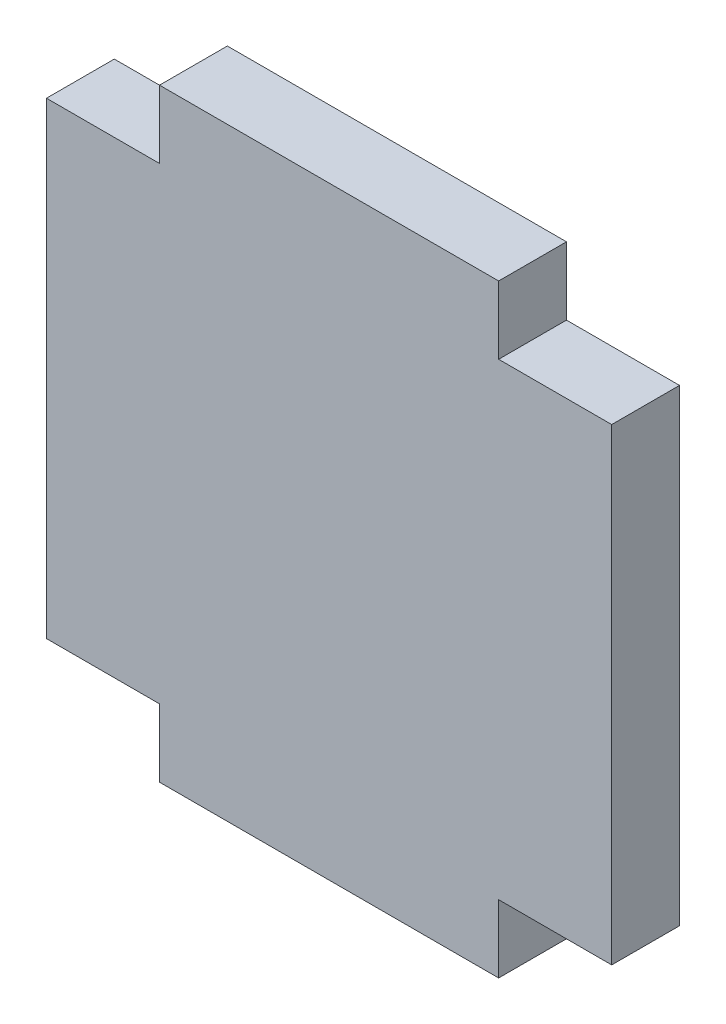
ISO-10303-21;
HEADER;
FILE_DESCRIPTION(('STEP AP214'),'2;1');
FILE_NAME('part.step','',(''),(''),'','','');
FILE_SCHEMA(('AUTOMOTIVE_DESIGN { 1 0 10303 214 1 1 1 1 }'));
ENDSEC;
DATA;
#1=APPLICATION_CONTEXT('core data for automotive mechanical design processes');
#2=APPLICATION_PROTOCOL_DEFINITION('international standard','automotive_design',2000,#1);
#3=PRODUCT_CONTEXT('',#1,'mechanical');
#4=PRODUCT('Part','Part','',(#3));
#5=PRODUCT_RELATED_PRODUCT_CATEGORY('part','',(#4));
#6=PRODUCT_DEFINITION_FORMATION('','',#4);
#7=PRODUCT_DEFINITION_CONTEXT('part definition',#1,'design');
#8=PRODUCT_DEFINITION('design','',#6,#7);
#9=PRODUCT_DEFINITION_SHAPE('','',#8);
#10=(LENGTH_UNIT() NAMED_UNIT(*) SI_UNIT(.MILLI.,.METRE.));
#11=(NAMED_UNIT(*) PLANE_ANGLE_UNIT() SI_UNIT($,.RADIAN.));
#12=(NAMED_UNIT(*) SI_UNIT($,.STERADIAN.) SOLID_ANGLE_UNIT());
#13=UNCERTAINTY_MEASURE_WITH_UNIT(LENGTH_MEASURE(1.E-05),#10,'distance_accuracy_value','');
#14=(GEOMETRIC_REPRESENTATION_CONTEXT(3) GLOBAL_UNCERTAINTY_ASSIGNED_CONTEXT((#13)) GLOBAL_UNIT_ASSIGNED_CONTEXT((#10,
#11,#12)) REPRESENTATION_CONTEXT('',''));
#15=CARTESIAN_POINT('',(0.,0.,0.));
#16=DIRECTION('',(0.,0.,1.));
#17=DIRECTION('',(1.,0.,0.));
#18=AXIS2_PLACEMENT_3D('',#15,#16,#17);
#19=CARTESIAN_POINT('',(0.,-10.35,3.));
#20=DIRECTION('',(0.,1.,0.));
#21=DIRECTION('',(0.,0.,1.));
#22=AXIS2_PLACEMENT_3D('',#19,#20,#21);
#23=PLANE('',#22);
#24=DIRECTION('',(1.,0.,0.));
#25=VECTOR('',#24,1.);
#26=CARTESIAN_POINT('',(0.,-10.35,0.));
#27=LINE('',#26,#25);
#28=CARTESIAN_POINT('',(-12.5,-10.35,0.));
#29=VERTEX_POINT('',#28);
#30=CARTESIAN_POINT('',(-7.5,-10.35,0.));
#31=VERTEX_POINT('',#30);
#32=EDGE_CURVE('E212',#29,#31,#27,.T.);
#33=ORIENTED_EDGE('',*,*,#32,.T.);
#34=DIRECTION('',(0.,0.,-1.));
#35=VECTOR('',#34,1.);
#36=CARTESIAN_POINT('',(-7.5,-10.35,3.));
#37=LINE('',#36,#35);
#38=CARTESIAN_POINT('',(-7.5,-10.35,3.));
#39=VERTEX_POINT('',#38);
#40=EDGE_CURVE('E11',#39,#31,#37,.T.);
#41=ORIENTED_EDGE('',*,*,#40,.F.);
#42=DIRECTION('',(1.,0.,0.));
#43=VECTOR('',#42,1.);
#44=CARTESIAN_POINT('',(0.,-10.35,3.));
#45=LINE('',#44,#43);
#46=CARTESIAN_POINT('',(-12.5,-10.35,3.));
#47=VERTEX_POINT('',#46);
#48=EDGE_CURVE('E102',#47,#39,#45,.T.);
#49=ORIENTED_EDGE('',*,*,#48,.F.);
#50=DIRECTION('',(0.,0.,-1.));
#51=VECTOR('',#50,1.);
#52=CARTESIAN_POINT('',(-12.5,-10.35,3.));
#53=LINE('',#52,#51);
#54=EDGE_CURVE('E53',#47,#29,#53,.T.);
#55=ORIENTED_EDGE('',*,*,#54,.T.);
#56=EDGE_LOOP('',(#33,#41,#49,#55));
#57=FACE_BOUND('',#56,.T.);
#58=ADVANCED_FACE('F36',(#57),#23,.F.);
#59=CARTESIAN_POINT('',(-7.5,0.,3.));
#60=DIRECTION('',(-1.,0.,0.));
#61=DIRECTION('',(0.,0.,1.));
#62=AXIS2_PLACEMENT_3D('',#59,#60,#61);
#63=PLANE('',#62);
#64=DIRECTION('',(0.,1.,0.));
#65=VECTOR('',#64,1.);
#66=CARTESIAN_POINT('',(-7.5,0.,0.));
#67=LINE('',#66,#65);
#68=CARTESIAN_POINT('',(-7.5,-13.35,0.));
#69=VERTEX_POINT('',#68);
#70=EDGE_CURVE('E211',#69,#31,#67,.T.);
#71=ORIENTED_EDGE('',*,*,#70,.F.);
#72=DIRECTION('',(0.,0.,-1.));
#73=VECTOR('',#72,1.);
#74=CARTESIAN_POINT('',(-7.5,-13.35,3.));
#75=LINE('',#74,#73);
#76=CARTESIAN_POINT('',(-7.5,-13.35,3.));
#77=VERTEX_POINT('',#76);
#78=EDGE_CURVE('E45',#77,#69,#75,.T.);
#79=ORIENTED_EDGE('',*,*,#78,.F.);
#80=DIRECTION('',(0.,1.,0.));
#81=VECTOR('',#80,1.);
#82=CARTESIAN_POINT('',(-7.5,0.,3.));
#83=LINE('',#82,#81);
#84=EDGE_CURVE('E174',#77,#39,#83,.T.);
#85=ORIENTED_EDGE('',*,*,#84,.T.);
#86=ORIENTED_EDGE('',*,*,#40,.T.);
#87=EDGE_LOOP('',(#71,#79,#85,#86));
#88=FACE_BOUND('',#87,.T.);
#89=ADVANCED_FACE('F38',(#88),#63,.T.);
#90=CARTESIAN_POINT('',(0.,-13.35,3.));
#91=DIRECTION('',(0.,-1.,0.));
#92=DIRECTION('',(0.,0.,-1.));
#93=AXIS2_PLACEMENT_3D('',#90,#91,#92);
#94=PLANE('',#93);
#95=DIRECTION('',(-1.,0.,0.));
#96=VECTOR('',#95,1.);
#97=CARTESIAN_POINT('',(0.,-13.35,0.));
#98=LINE('',#97,#96);
#99=CARTESIAN_POINT('',(7.5,-13.35,0.));
#100=VERTEX_POINT('',#99);
#101=EDGE_CURVE('E207',#100,#69,#98,.T.);
#102=ORIENTED_EDGE('',*,*,#101,.F.);
#103=DIRECTION('',(0.,0.,-1.));
#104=VECTOR('',#103,1.);
#105=CARTESIAN_POINT('',(7.5,-13.35,3.));
#106=LINE('',#105,#104);
#107=CARTESIAN_POINT('',(7.5,-13.35,3.));
#108=VERTEX_POINT('',#107);
#109=EDGE_CURVE('E201',#108,#100,#106,.T.);
#110=ORIENTED_EDGE('',*,*,#109,.F.);
#111=DIRECTION('',(-1.,0.,0.));
#112=VECTOR('',#111,1.);
#113=CARTESIAN_POINT('',(0.,-13.35,3.));
#114=LINE('',#113,#112);
#115=EDGE_CURVE('E171',#108,#77,#114,.T.);
#116=ORIENTED_EDGE('',*,*,#115,.T.);
#117=ORIENTED_EDGE('',*,*,#78,.T.);
#118=EDGE_LOOP('',(#102,#110,#116,#117));
#119=FACE_BOUND('',#118,.T.);
#120=ADVANCED_FACE('F205',(#119),#94,.T.);
#121=CARTESIAN_POINT('',(7.5,0.,3.));
#122=DIRECTION('',(-1.,0.,0.));
#123=DIRECTION('',(0.,0.,1.));
#124=AXIS2_PLACEMENT_3D('',#121,#122,#123);
#125=PLANE('',#124);
#126=DIRECTION('',(0.,1.,0.));
#127=VECTOR('',#126,1.);
#128=CARTESIAN_POINT('',(7.5,0.,0.));
#129=LINE('',#128,#127);
#130=CARTESIAN_POINT('',(7.5,-10.35,0.));
#131=VERTEX_POINT('',#130);
#132=EDGE_CURVE('E217',#100,#131,#129,.T.);
#133=ORIENTED_EDGE('',*,*,#132,.T.);
#134=DIRECTION('',(0.,0.,-1.));
#135=VECTOR('',#134,1.);
#136=CARTESIAN_POINT('',(7.5,-10.35,3.));
#137=LINE('',#136,#135);
#138=CARTESIAN_POINT('',(7.5,-10.35,3.));
#139=VERTEX_POINT('',#138);
#140=EDGE_CURVE('E198',#139,#131,#137,.T.);
#141=ORIENTED_EDGE('',*,*,#140,.F.);
#142=DIRECTION('',(0.,1.,0.));
#143=VECTOR('',#142,1.);
#144=CARTESIAN_POINT('',(7.5,0.,3.));
#145=LINE('',#144,#143);
#146=EDGE_CURVE('E167',#108,#139,#145,.T.);
#147=ORIENTED_EDGE('',*,*,#146,.F.);
#148=ORIENTED_EDGE('',*,*,#109,.T.);
#149=EDGE_LOOP('',(#133,#141,#147,#148));
#150=FACE_BOUND('',#149,.T.);
#151=ADVANCED_FACE('F264',(#150),#125,.F.);
#152=CARTESIAN_POINT('',(12.5,-10.35,0.));
#153=VERTEX_POINT('',#152);
#154=EDGE_CURVE('E219',#131,#153,#27,.T.);
#155=ORIENTED_EDGE('',*,*,#154,.T.);
#156=DIRECTION('',(0.,0.,-1.));
#157=VECTOR('',#156,1.);
#158=CARTESIAN_POINT('',(12.5,-10.35,3.));
#159=LINE('',#158,#157);
#160=CARTESIAN_POINT('',(12.5,-10.35,3.));
#161=VERTEX_POINT('',#160);
#162=EDGE_CURVE('E195',#161,#153,#159,.T.);
#163=ORIENTED_EDGE('',*,*,#162,.F.);
#164=EDGE_CURVE('E164',#139,#161,#45,.T.);
#165=ORIENTED_EDGE('',*,*,#164,.F.);
#166=ORIENTED_EDGE('',*,*,#140,.T.);
#167=EDGE_LOOP('',(#155,#163,#165,#166));
#168=FACE_BOUND('',#167,.T.);
#169=ADVANCED_FACE('F244',(#168),#23,.F.);
#170=CARTESIAN_POINT('',(12.5,0.,3.));
#171=DIRECTION('',(-1.,0.,0.));
#172=DIRECTION('',(0.,0.,1.));
#173=AXIS2_PLACEMENT_3D('',#170,#171,#172);
#174=PLANE('',#173);
#175=DIRECTION('',(0.,1.,0.));
#176=VECTOR('',#175,1.);
#177=CARTESIAN_POINT('',(12.5,0.,0.));
#178=LINE('',#177,#176);
#179=CARTESIAN_POINT('',(12.5,10.35,0.));
#180=VERTEX_POINT('',#179);
#181=EDGE_CURVE('E223',#153,#180,#178,.T.);
#182=ORIENTED_EDGE('',*,*,#181,.T.);
#183=DIRECTION('',(0.,0.,-1.));
#184=VECTOR('',#183,1.);
#185=CARTESIAN_POINT('',(12.5,10.35,3.));
#186=LINE('',#185,#184);
#187=CARTESIAN_POINT('',(12.5,10.35,3.));
#188=VERTEX_POINT('',#187);
#189=EDGE_CURVE('E193',#188,#180,#186,.T.);
#190=ORIENTED_EDGE('',*,*,#189,.F.);
#191=DIRECTION('',(0.,1.,0.));
#192=VECTOR('',#191,1.);
#193=CARTESIAN_POINT('',(12.5,0.,3.));
#194=LINE('',#193,#192);
#195=EDGE_CURVE('E160',#161,#188,#194,.T.);
#196=ORIENTED_EDGE('',*,*,#195,.F.);
#197=ORIENTED_EDGE('',*,*,#162,.T.);
#198=EDGE_LOOP('',(#182,#190,#196,#197));
#199=FACE_BOUND('',#198,.T.);
#200=ADVANCED_FACE('F240',(#199),#174,.F.);
#201=CARTESIAN_POINT('',(0.,10.35,3.));
#202=DIRECTION('',(0.,1.,0.));
#203=DIRECTION('',(0.,0.,1.));
#204=AXIS2_PLACEMENT_3D('',#201,#202,#203);
#205=PLANE('',#204);
#206=DIRECTION('',(1.,0.,0.));
#207=VECTOR('',#206,1.);
#208=CARTESIAN_POINT('',(0.,10.35,0.));
#209=LINE('',#208,#207);
#210=CARTESIAN_POINT('',(7.5,10.35,0.));
#211=VERTEX_POINT('',#210);
#212=EDGE_CURVE('E182',#211,#180,#209,.T.);
#213=ORIENTED_EDGE('',*,*,#212,.F.);
#214=DIRECTION('',(0.,0.,-1.));
#215=VECTOR('',#214,1.);
#216=CARTESIAN_POINT('',(7.5,10.35,3.));
#217=LINE('',#216,#215);
#218=CARTESIAN_POINT('',(7.5,10.35,3.));
#219=VERTEX_POINT('',#218);
#220=EDGE_CURVE('E191',#219,#211,#217,.T.);
#221=ORIENTED_EDGE('',*,*,#220,.F.);
#222=DIRECTION('',(1.,0.,0.));
#223=VECTOR('',#222,1.);
#224=CARTESIAN_POINT('',(0.,10.35,3.));
#225=LINE('',#224,#223);
#226=EDGE_CURVE('E154',#219,#188,#225,.T.);
#227=ORIENTED_EDGE('',*,*,#226,.T.);
#228=ORIENTED_EDGE('',*,*,#189,.T.);
#229=EDGE_LOOP('',(#213,#221,#227,#228));
#230=FACE_BOUND('',#229,.T.);
#231=ADVANCED_FACE('F237',(#230),#205,.T.);
#232=CARTESIAN_POINT('',(7.5,0.,3.));
#233=DIRECTION('',(1.,0.,0.));
#234=DIRECTION('',(0.,0.,-1.));
#235=AXIS2_PLACEMENT_3D('',#232,#233,#234);
#236=PLANE('',#235);
#237=DIRECTION('',(0.,-1.,0.));
#238=VECTOR('',#237,1.);
#239=CARTESIAN_POINT('',(7.5,0.,0.));
#240=LINE('',#239,#238);
#241=CARTESIAN_POINT('',(7.5,13.35,0.));
#242=VERTEX_POINT('',#241);
#243=EDGE_CURVE('E227',#242,#211,#240,.T.);
#244=ORIENTED_EDGE('',*,*,#243,.F.);
#245=DIRECTION('',(0.,0.,-1.));
#246=VECTOR('',#245,1.);
#247=CARTESIAN_POINT('',(7.5,13.35,3.));
#248=LINE('',#247,#246);
#249=CARTESIAN_POINT('',(7.5,13.35,3.));
#250=VERTEX_POINT('',#249);
#251=EDGE_CURVE('E189',#250,#242,#248,.T.);
#252=ORIENTED_EDGE('',*,*,#251,.F.);
#253=DIRECTION('',(0.,-1.,0.));
#254=VECTOR('',#253,1.);
#255=CARTESIAN_POINT('',(7.5,0.,3.));
#256=LINE('',#255,#254);
#257=EDGE_CURVE('E159',#250,#219,#256,.T.);
#258=ORIENTED_EDGE('',*,*,#257,.T.);
#259=ORIENTED_EDGE('',*,*,#220,.T.);
#260=EDGE_LOOP('',(#244,#252,#258,#259));
#261=FACE_BOUND('',#260,.T.);
#262=ADVANCED_FACE('F235',(#261),#236,.T.);
#263=CARTESIAN_POINT('',(0.,13.35,3.));
#264=DIRECTION('',(0.,-1.,0.));
#265=DIRECTION('',(0.,0.,-1.));
#266=AXIS2_PLACEMENT_3D('',#263,#264,#265);
#267=PLANE('',#266);
#268=DIRECTION('',(-1.,0.,0.));
#269=VECTOR('',#268,1.);
#270=CARTESIAN_POINT('',(0.,13.35,0.));
#271=LINE('',#270,#269);
#272=CARTESIAN_POINT('',(-7.5,13.35,0.));
#273=VERTEX_POINT('',#272);
#274=EDGE_CURVE('E229',#242,#273,#271,.T.);
#275=ORIENTED_EDGE('',*,*,#274,.T.);
#276=DIRECTION('',(0.,0.,-1.));
#277=VECTOR('',#276,1.);
#278=CARTESIAN_POINT('',(-7.5,13.35,3.));
#279=LINE('',#278,#277);
#280=CARTESIAN_POINT('',(-7.5,13.35,3.));
#281=VERTEX_POINT('',#280);
#282=EDGE_CURVE('E149',#281,#273,#279,.T.);
#283=ORIENTED_EDGE('',*,*,#282,.F.);
#284=DIRECTION('',(-1.,0.,0.));
#285=VECTOR('',#284,1.);
#286=CARTESIAN_POINT('',(0.,13.35,3.));
#287=LINE('',#286,#285);
#288=EDGE_CURVE('E137',#250,#281,#287,.T.);
#289=ORIENTED_EDGE('',*,*,#288,.F.);
#290=ORIENTED_EDGE('',*,*,#251,.T.);
#291=EDGE_LOOP('',(#275,#283,#289,#290));
#292=FACE_BOUND('',#291,.T.);
#293=ADVANCED_FACE('F232',(#292),#267,.F.);
#294=CARTESIAN_POINT('',(-7.5,0.,3.));
#295=DIRECTION('',(1.,0.,0.));
#296=DIRECTION('',(0.,0.,-1.));
#297=AXIS2_PLACEMENT_3D('',#294,#295,#296);
#298=PLANE('',#297);
#299=DIRECTION('',(0.,-1.,0.));
#300=VECTOR('',#299,1.);
#301=CARTESIAN_POINT('',(-7.5,0.,0.));
#302=LINE('',#301,#300);
#303=CARTESIAN_POINT('',(-7.5,10.35,0.));
#304=VERTEX_POINT('',#303);
#305=EDGE_CURVE('E146',#273,#304,#302,.T.);
#306=ORIENTED_EDGE('',*,*,#305,.T.);
#307=DIRECTION('',(0.,0.,-1.));
#308=VECTOR('',#307,1.);
#309=CARTESIAN_POINT('',(-7.5,10.35,3.));
#310=LINE('',#309,#308);
#311=CARTESIAN_POINT('',(-7.5,10.35,3.));
#312=VERTEX_POINT('',#311);
#313=EDGE_CURVE('E143',#312,#304,#310,.T.);
#314=ORIENTED_EDGE('',*,*,#313,.F.);
#315=DIRECTION('',(0.,-1.,0.));
#316=VECTOR('',#315,1.);
#317=CARTESIAN_POINT('',(-7.5,0.,3.));
#318=LINE('',#317,#316);
#319=EDGE_CURVE('E130',#281,#312,#318,.T.);
#320=ORIENTED_EDGE('',*,*,#319,.F.);
#321=ORIENTED_EDGE('',*,*,#282,.T.);
#322=EDGE_LOOP('',(#306,#314,#320,#321));
#323=FACE_BOUND('',#322,.T.);
#324=ADVANCED_FACE('F144',(#323),#298,.F.);
#325=CARTESIAN_POINT('',(-12.5,10.35,0.));
#326=VERTEX_POINT('',#325);
#327=EDGE_CURVE('E178',#326,#304,#209,.T.);
#328=ORIENTED_EDGE('',*,*,#327,.F.);
#329=DIRECTION('',(0.,0.,-1.));
#330=VECTOR('',#329,1.);
#331=CARTESIAN_POINT('',(-12.5,10.35,3.));
#332=LINE('',#331,#330);
#333=CARTESIAN_POINT('',(-12.5,10.35,3.));
#334=VERTEX_POINT('',#333);
#335=EDGE_CURVE('E90',#334,#326,#332,.T.);
#336=ORIENTED_EDGE('',*,*,#335,.F.);
#337=EDGE_CURVE('E134',#334,#312,#225,.T.);
#338=ORIENTED_EDGE('',*,*,#337,.T.);
#339=ORIENTED_EDGE('',*,*,#313,.T.);
#340=EDGE_LOOP('',(#328,#336,#338,#339));
#341=FACE_BOUND('',#340,.T.);
#342=ADVANCED_FACE('F151',(#341),#205,.T.);
#343=CARTESIAN_POINT('',(-12.5,0.,3.));
#344=DIRECTION('',(-1.,0.,0.));
#345=DIRECTION('',(0.,0.,1.));
#346=AXIS2_PLACEMENT_3D('',#343,#344,#345);
#347=PLANE('',#346);
#348=DIRECTION('',(0.,1.,0.));
#349=VECTOR('',#348,1.);
#350=CARTESIAN_POINT('',(-12.5,0.,0.));
#351=LINE('',#350,#349);
#352=EDGE_CURVE('E176',#29,#326,#351,.T.);
#353=ORIENTED_EDGE('',*,*,#352,.F.);
#354=ORIENTED_EDGE('',*,*,#54,.F.);
#355=DIRECTION('',(0.,1.,0.));
#356=VECTOR('',#355,1.);
#357=CARTESIAN_POINT('',(-12.5,0.,3.));
#358=LINE('',#357,#356);
#359=EDGE_CURVE('E152',#47,#334,#358,.T.);
#360=ORIENTED_EDGE('',*,*,#359,.T.);
#361=ORIENTED_EDGE('',*,*,#335,.T.);
#362=EDGE_LOOP('',(#353,#354,#360,#361));
#363=FACE_BOUND('',#362,.T.);
#364=ADVANCED_FACE('F246',(#363),#347,.T.);
#365=CARTESIAN_POINT('',(0.,0.,3.));
#366=DIRECTION('',(0.,0.,1.));
#367=DIRECTION('',(1.,0.,0.));
#368=AXIS2_PLACEMENT_3D('',#365,#366,#367);
#369=PLANE('',#368);
#370=ORIENTED_EDGE('',*,*,#48,.T.);
#371=ORIENTED_EDGE('',*,*,#84,.F.);
#372=ORIENTED_EDGE('',*,*,#115,.F.);
#373=ORIENTED_EDGE('',*,*,#146,.T.);
#374=ORIENTED_EDGE('',*,*,#164,.T.);
#375=ORIENTED_EDGE('',*,*,#195,.T.);
#376=ORIENTED_EDGE('',*,*,#226,.F.);
#377=ORIENTED_EDGE('',*,*,#257,.F.);
#378=ORIENTED_EDGE('',*,*,#288,.T.);
#379=ORIENTED_EDGE('',*,*,#319,.T.);
#380=ORIENTED_EDGE('',*,*,#337,.F.);
#381=ORIENTED_EDGE('',*,*,#359,.F.);
#382=EDGE_LOOP('',(#370,#371,#372,#373,#374,#375,#376,#377,#378,#379,#380,#381));
#383=FACE_BOUND('',#382,.T.);
#384=ADVANCED_FACE('F132',(#383),#369,.T.);
#385=CARTESIAN_POINT('',(0.,0.,0.));
#386=DIRECTION('',(0.,0.,1.));
#387=DIRECTION('',(1.,0.,0.));
#388=AXIS2_PLACEMENT_3D('',#385,#386,#387);
#389=PLANE('',#388);
#390=ORIENTED_EDGE('',*,*,#32,.F.);
#391=ORIENTED_EDGE('',*,*,#352,.T.);
#392=ORIENTED_EDGE('',*,*,#327,.T.);
#393=ORIENTED_EDGE('',*,*,#305,.F.);
#394=ORIENTED_EDGE('',*,*,#274,.F.);
#395=ORIENTED_EDGE('',*,*,#243,.T.);
#396=ORIENTED_EDGE('',*,*,#212,.T.);
#397=ORIENTED_EDGE('',*,*,#181,.F.);
#398=ORIENTED_EDGE('',*,*,#154,.F.);
#399=ORIENTED_EDGE('',*,*,#132,.F.);
#400=ORIENTED_EDGE('',*,*,#101,.T.);
#401=ORIENTED_EDGE('',*,*,#70,.T.);
#402=EDGE_LOOP('',(#390,#391,#392,#393,#394,#395,#396,#397,#398,#399,#400,#401));
#403=FACE_BOUND('',#402,.T.);
#404=ADVANCED_FACE('F215',(#403),#389,.F.);
#405=CLOSED_SHELL('',(#58,#89,#120,#151,#169,#200,#231,#262,#293,#324,#342,#364,#384,#404));
#406=MANIFOLD_SOLID_BREP('B2',#405);
#407=ADVANCED_BREP_SHAPE_REPRESENTATION('',(#18,#406),#14);
#408=SHAPE_DEFINITION_REPRESENTATION(#9,#407);
ENDSEC;
END-ISO-10303-21;
